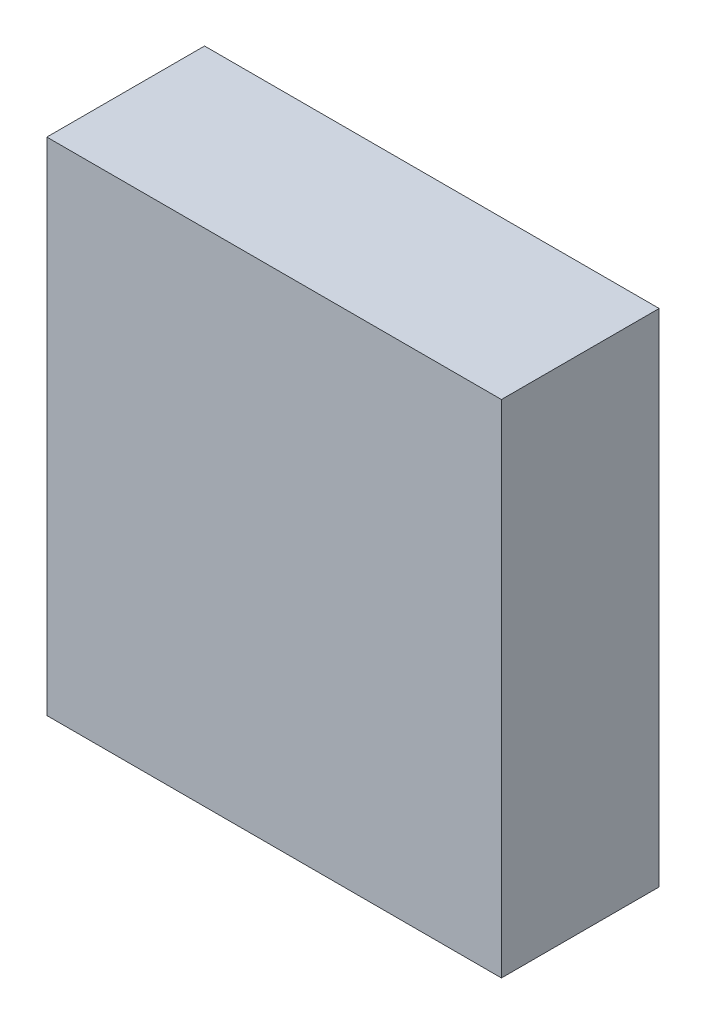
ISO-10303-21;
HEADER;
FILE_DESCRIPTION(('STEP AP214'),'2;1');
FILE_NAME('part.step','',(''),(''),'','','');
FILE_SCHEMA(('AUTOMOTIVE_DESIGN { 1 0 10303 214 1 1 1 1 }'));
ENDSEC;
DATA;
#1=APPLICATION_CONTEXT('core data for automotive mechanical design processes');
#2=APPLICATION_PROTOCOL_DEFINITION('international standard','automotive_design',2000,#1);
#3=PRODUCT_CONTEXT('',#1,'mechanical');
#4=PRODUCT('Part','Part','',(#3));
#5=PRODUCT_RELATED_PRODUCT_CATEGORY('part','',(#4));
#6=PRODUCT_DEFINITION_FORMATION('','',#4);
#7=PRODUCT_DEFINITION_CONTEXT('part definition',#1,'design');
#8=PRODUCT_DEFINITION('design','',#6,#7);
#9=PRODUCT_DEFINITION_SHAPE('','',#8);
#10=(LENGTH_UNIT() NAMED_UNIT(*) SI_UNIT(.MILLI.,.METRE.));
#11=(NAMED_UNIT(*) PLANE_ANGLE_UNIT() SI_UNIT($,.RADIAN.));
#12=(NAMED_UNIT(*) SI_UNIT($,.STERADIAN.) SOLID_ANGLE_UNIT());
#13=UNCERTAINTY_MEASURE_WITH_UNIT(LENGTH_MEASURE(1.E-05),#10,'distance_accuracy_value','');
#14=(GEOMETRIC_REPRESENTATION_CONTEXT(3) GLOBAL_UNCERTAINTY_ASSIGNED_CONTEXT((#13)) GLOBAL_UNIT_ASSIGNED_CONTEXT((#10,
#11,#12)) REPRESENTATION_CONTEXT('',''));
#15=CARTESIAN_POINT('',(0.,0.,0.));
#16=DIRECTION('',(0.,0.,1.));
#17=DIRECTION('',(1.,0.,0.));
#18=AXIS2_PLACEMENT_3D('',#15,#16,#17);
#19=CARTESIAN_POINT('',(-2.45000325360994,2.69999866914245,0.));
#20=DIRECTION('',(-1.,8.74227765734759E-08,0.));
#21=DIRECTION('',(-8.74227765734759E-08,-1.,0.));
#22=AXIS2_PLACEMENT_3D('',#19,#20,#21);
#23=PLANE('',#22);
#24=DIRECTION('',(-8.74227765512293E-08,-0.999999999999996,0.));
#25=VECTOR('',#24,1.);
#26=CARTESIAN_POINT('',(-2.45000325360994,2.69999866914245,0.));
#27=LINE('',#26,#25);
#28=CARTESIAN_POINT('',(-2.45000325360994,2.69999866914245,0.));
#29=VERTEX_POINT('',#28);
#30=CARTESIAN_POINT('',(-2.4500037256924,-2.69999522734193,0.));
#31=VERTEX_POINT('',#30);
#32=EDGE_CURVE('E11',#29,#31,#27,.T.);
#33=ORIENTED_EDGE('',*,*,#32,.T.);
#34=DIRECTION('',(0.,0.,1.));
#35=VECTOR('',#34,1.);
#36=CARTESIAN_POINT('',(-2.4500037256924,-2.69999522734193,0.));
#37=LINE('',#36,#35);
#38=CARTESIAN_POINT('',(-2.4500037256924,-2.69999522734193,1.6999990940094));
#39=VERTEX_POINT('',#38);
#40=EDGE_CURVE('E88',#31,#39,#37,.T.);
#41=ORIENTED_EDGE('',*,*,#40,.T.);
#42=DIRECTION('',(-8.74227765512293E-08,-0.999999999999996,0.));
#43=VECTOR('',#42,1.);
#44=CARTESIAN_POINT('',(-2.45000325360994,2.69999866914245,1.6999990940094));
#45=LINE('',#44,#43);
#46=CARTESIAN_POINT('',(-2.45000325360994,2.69999866914245,1.6999990940094));
#47=VERTEX_POINT('',#46);
#48=EDGE_CURVE('E83',#47,#39,#45,.T.);
#49=ORIENTED_EDGE('',*,*,#48,.F.);
#50=DIRECTION('',(0.,0.,1.));
#51=VECTOR('',#50,1.);
#52=CARTESIAN_POINT('',(-2.45000325360994,2.69999866914243,0.));
#53=LINE('',#52,#51);
#54=EDGE_CURVE('E72',#29,#47,#53,.T.);
#55=ORIENTED_EDGE('',*,*,#54,.F.);
#56=EDGE_LOOP('',(#33,#41,#49,#55));
#57=FACE_BOUND('',#56,.T.);
#58=ADVANCED_FACE('F17',(#57),#23,.T.);
#59=CARTESIAN_POINT('',(-2.4500037256924,-2.69999522734193,0.));
#60=DIRECTION('',(-8.74227765734759E-08,-1.,0.));
#61=DIRECTION('',(1.,-8.74227765734759E-08,0.));
#62=AXIS2_PLACEMENT_3D('',#59,#60,#61);
#63=PLANE('',#62);
#64=DIRECTION('',(0.999999999999996,-8.74227765649347E-08,0.));
#65=VECTOR('',#64,1.);
#66=CARTESIAN_POINT('',(-2.4500037256924,-2.69999522734193,0.));
#67=LINE('',#66,#65);
#68=CARTESIAN_POINT('',(2.45000542958104,-2.69999565571435,0.));
#69=VERTEX_POINT('',#68);
#70=EDGE_CURVE('E24',#31,#69,#67,.T.);
#71=ORIENTED_EDGE('',*,*,#70,.T.);
#72=DIRECTION('',(0.,0.,1.));
#73=VECTOR('',#72,1.);
#74=CARTESIAN_POINT('',(2.45000542958104,-2.69999565571434,0.));
#75=LINE('',#74,#73);
#76=CARTESIAN_POINT('',(2.45000542958104,-2.69999565571435,1.6999990940094));
#77=VERTEX_POINT('',#76);
#78=EDGE_CURVE('E85',#69,#77,#75,.T.);
#79=ORIENTED_EDGE('',*,*,#78,.T.);
#80=DIRECTION('',(0.999999999999996,-8.74227765649347E-08,0.));
#81=VECTOR('',#80,1.);
#82=CARTESIAN_POINT('',(-2.4500037256924,-2.69999522734193,1.6999990940094));
#83=LINE('',#82,#81);
#84=EDGE_CURVE('E66',#39,#77,#83,.T.);
#85=ORIENTED_EDGE('',*,*,#84,.F.);
#86=ORIENTED_EDGE('',*,*,#40,.F.);
#87=EDGE_LOOP('',(#71,#79,#85,#86));
#88=FACE_BOUND('',#87,.T.);
#89=ADVANCED_FACE('F89',(#88),#63,.T.);
#90=CARTESIAN_POINT('',(2.45000542958104,-2.69999565571435,0.));
#91=DIRECTION('',(1.,-8.74227765734759E-08,0.));
#92=DIRECTION('',(8.74227765734759E-08,1.,0.));
#93=AXIS2_PLACEMENT_3D('',#90,#91,#92);
#94=PLANE('',#93);
#95=DIRECTION('',(8.74227765512293E-08,0.999999999999996,0.));
#96=VECTOR('',#95,1.);
#97=CARTESIAN_POINT('',(2.45000542958104,-2.69999565571435,0.));
#98=LINE('',#97,#96);
#99=CARTESIAN_POINT('',(2.4500059016635,2.69999824077003,0.));
#100=VERTEX_POINT('',#99);
#101=EDGE_CURVE('E62',#69,#100,#98,.T.);
#102=ORIENTED_EDGE('',*,*,#101,.T.);
#103=DIRECTION('',(0.,0.,1.));
#104=VECTOR('',#103,1.);
#105=CARTESIAN_POINT('',(2.4500059016635,2.69999824077003,0.));
#106=LINE('',#105,#104);
#107=CARTESIAN_POINT('',(2.4500059016635,2.69999824077003,1.6999990940094));
#108=VERTEX_POINT('',#107);
#109=EDGE_CURVE('E55',#100,#108,#106,.T.);
#110=ORIENTED_EDGE('',*,*,#109,.T.);
#111=DIRECTION('',(8.74227765512293E-08,0.999999999999996,0.));
#112=VECTOR('',#111,1.);
#113=CARTESIAN_POINT('',(2.45000542958104,-2.69999565571435,1.6999990940094));
#114=LINE('',#113,#112);
#115=EDGE_CURVE('E59',#77,#108,#114,.T.);
#116=ORIENTED_EDGE('',*,*,#115,.F.);
#117=ORIENTED_EDGE('',*,*,#78,.F.);
#118=EDGE_LOOP('',(#102,#110,#116,#117));
#119=FACE_BOUND('',#118,.T.);
#120=ADVANCED_FACE('F57',(#119),#94,.T.);
#121=CARTESIAN_POINT('',(2.4500059016635,2.69999824077003,0.));
#122=DIRECTION('',(8.74227765734759E-08,1.,0.));
#123=DIRECTION('',(-1.,8.74227765734759E-08,0.));
#124=AXIS2_PLACEMENT_3D('',#121,#122,#123);
#125=PLANE('',#124);
#126=DIRECTION('',(-0.999999999999996,8.74227765649347E-08,0.));
#127=VECTOR('',#126,1.);
#128=CARTESIAN_POINT('',(2.4500059016635,2.69999824077003,0.));
#129=LINE('',#128,#127);
#130=EDGE_CURVE('E65',#100,#29,#129,.T.);
#131=ORIENTED_EDGE('',*,*,#130,.T.);
#132=ORIENTED_EDGE('',*,*,#54,.T.);
#133=DIRECTION('',(-0.999999999999996,8.74227765649347E-08,0.));
#134=VECTOR('',#133,1.);
#135=CARTESIAN_POINT('',(2.4500059016635,2.69999824077003,1.6999990940094));
#136=LINE('',#135,#134);
#137=EDGE_CURVE('E70',#108,#47,#136,.T.);
#138=ORIENTED_EDGE('',*,*,#137,.F.);
#139=ORIENTED_EDGE('',*,*,#109,.F.);
#140=EDGE_LOOP('',(#131,#132,#138,#139));
#141=FACE_BOUND('',#140,.T.);
#142=ADVANCED_FACE('F71',(#141),#125,.T.);
#143=CARTESIAN_POINT('',(191.775009155273,74.8249816894531,1.6999990940094));
#144=DIRECTION('',(0.,0.,1.));
#145=DIRECTION('',(-1.,8.74227765734759E-08,0.));
#146=AXIS2_PLACEMENT_3D('',#143,#144,#145);
#147=PLANE('',#146);
#148=ORIENTED_EDGE('',*,*,#48,.T.);
#149=ORIENTED_EDGE('',*,*,#84,.T.);
#150=ORIENTED_EDGE('',*,*,#115,.T.);
#151=ORIENTED_EDGE('',*,*,#137,.T.);
#152=EDGE_LOOP('',(#148,#149,#150,#151));
#153=FACE_BOUND('',#152,.T.);
#154=ADVANCED_FACE('F76',(#153),#147,.T.);
#155=CARTESIAN_POINT('',(191.775009155273,74.8249816894531,0.));
#156=DIRECTION('',(0.,0.,1.));
#157=DIRECTION('',(-1.,8.74227765734759E-08,0.));
#158=AXIS2_PLACEMENT_3D('',#155,#156,#157);
#159=PLANE('',#158);
#160=ORIENTED_EDGE('',*,*,#130,.F.);
#161=ORIENTED_EDGE('',*,*,#101,.F.);
#162=ORIENTED_EDGE('',*,*,#70,.F.);
#163=ORIENTED_EDGE('',*,*,#32,.F.);
#164=EDGE_LOOP('',(#160,#161,#162,#163));
#165=FACE_BOUND('',#164,.T.);
#166=ADVANCED_FACE('F91',(#165),#159,.F.);
#167=CLOSED_SHELL('',(#58,#89,#120,#142,#154,#166));
#168=MANIFOLD_SOLID_BREP('B1',#167);
#169=ADVANCED_BREP_SHAPE_REPRESENTATION('',(#18,#168),#14);
#170=SHAPE_DEFINITION_REPRESENTATION(#9,#169);
ENDSEC;
END-ISO-10303-21;
